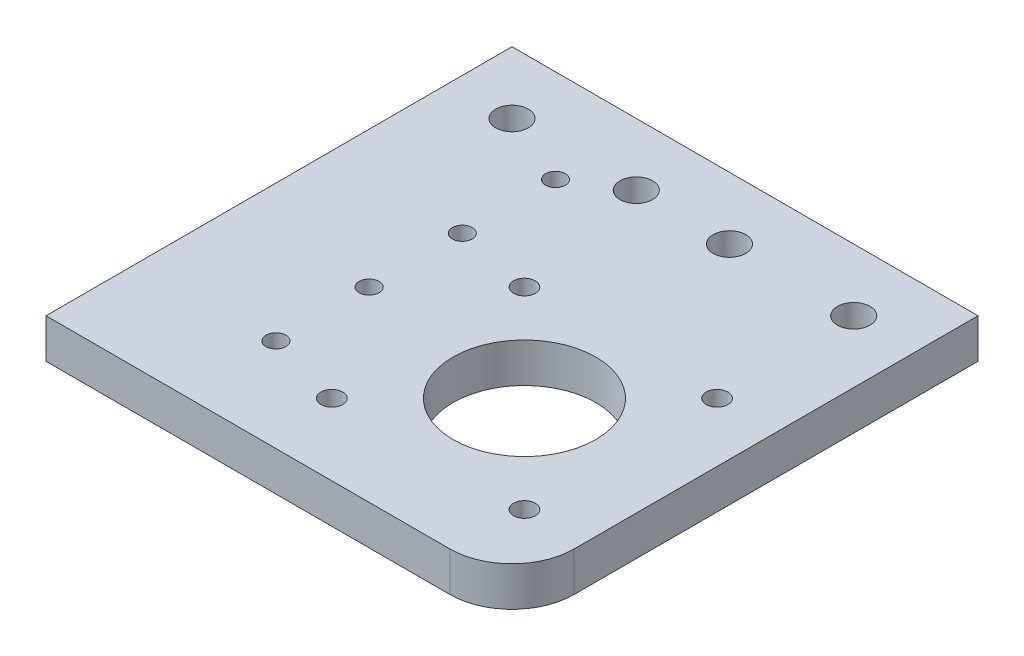
ISO-10303-21;
HEADER;
FILE_DESCRIPTION(('STEP AP214'),'2;1');
FILE_NAME('part.step','',(''),(''),'','','');
FILE_SCHEMA(('AUTOMOTIVE_DESIGN { 1 0 10303 214 1 1 1 1 }'));
ENDSEC;
DATA;
#1=APPLICATION_CONTEXT('core data for automotive mechanical design processes');
#2=APPLICATION_PROTOCOL_DEFINITION('international standard','automotive_design',2000,#1);
#3=PRODUCT_CONTEXT('',#1,'mechanical');
#4=PRODUCT('Part','Part','',(#3));
#5=PRODUCT_RELATED_PRODUCT_CATEGORY('part','',(#4));
#6=PRODUCT_DEFINITION_FORMATION('','',#4);
#7=PRODUCT_DEFINITION_CONTEXT('part definition',#1,'design');
#8=PRODUCT_DEFINITION('design','',#6,#7);
#9=PRODUCT_DEFINITION_SHAPE('','',#8);
#10=(LENGTH_UNIT() NAMED_UNIT(*) SI_UNIT(.MILLI.,.METRE.));
#11=(NAMED_UNIT(*) PLANE_ANGLE_UNIT() SI_UNIT($,.RADIAN.));
#12=(NAMED_UNIT(*) SI_UNIT($,.STERADIAN.) SOLID_ANGLE_UNIT());
#13=UNCERTAINTY_MEASURE_WITH_UNIT(LENGTH_MEASURE(1.E-05),#10,'distance_accuracy_value','');
#14=(GEOMETRIC_REPRESENTATION_CONTEXT(3) GLOBAL_UNCERTAINTY_ASSIGNED_CONTEXT((#13)) GLOBAL_UNIT_ASSIGNED_CONTEXT((#10,
#11,#12)) REPRESENTATION_CONTEXT('',''));
#15=CARTESIAN_POINT('',(0.,0.,0.));
#16=DIRECTION('',(0.,0.,1.));
#17=DIRECTION('',(1.,0.,0.));
#18=AXIS2_PLACEMENT_3D('',#15,#16,#17);
#19=CARTESIAN_POINT('',(0.,6.35,0.));
#20=DIRECTION('',(0.,1.,0.));
#21=DIRECTION('',(0.,0.,1.));
#22=AXIS2_PLACEMENT_3D('',#19,#20,#21);
#23=PLANE('',#22);
#24=CARTESIAN_POINT('',(21.9999999999996,6.35,60.));
#25=DIRECTION('',(0.,1.,0.));
#26=DIRECTION('',(0.,0.,1.));
#27=AXIS2_PLACEMENT_3D('',#24,#25,#26);
#28=CIRCLE('',#27,1.6);
#29=CARTESIAN_POINT('',(21.9999999999996,6.35,61.6));
#30=VERTEX_POINT('',#29);
#31=EDGE_CURVE('E191',#30,#30,#28,.T.);
#32=ORIENTED_EDGE('',*,*,#31,.F.);
#33=EDGE_LOOP('',(#32));
#34=FACE_BOUND('',#33,.T.);
#35=CARTESIAN_POINT('',(21.9999999999996,6.35,45.));
#36=DIRECTION('',(0.,1.,0.));
#37=DIRECTION('',(0.,0.,1.));
#38=AXIS2_PLACEMENT_3D('',#35,#36,#37);
#39=CIRCLE('',#38,1.6);
#40=CARTESIAN_POINT('',(21.9999999999996,6.35,46.6));
#41=VERTEX_POINT('',#40);
#42=EDGE_CURVE('E185',#41,#41,#39,.T.);
#43=ORIENTED_EDGE('',*,*,#42,.F.);
#44=EDGE_LOOP('',(#43));
#45=FACE_BOUND('',#44,.T.);
#46=CARTESIAN_POINT('',(21.9999999999996,6.35,30.));
#47=DIRECTION('',(0.,1.,0.));
#48=DIRECTION('',(0.,0.,1.));
#49=AXIS2_PLACEMENT_3D('',#46,#47,#48);
#50=CIRCLE('',#49,1.6);
#51=CARTESIAN_POINT('',(21.9999999999996,6.35,31.6));
#52=VERTEX_POINT('',#51);
#53=EDGE_CURVE('E179',#52,#52,#50,.T.);
#54=ORIENTED_EDGE('',*,*,#53,.F.);
#55=EDGE_LOOP('',(#54));
#56=FACE_BOUND('',#55,.T.);
#57=CARTESIAN_POINT('',(21.9999999999996,6.35,15.));
#58=DIRECTION('',(0.,1.,0.));
#59=DIRECTION('',(0.,0.,1.));
#60=AXIS2_PLACEMENT_3D('',#57,#58,#59);
#61=CIRCLE('',#60,1.6);
#62=CARTESIAN_POINT('',(21.9999999999996,6.35,16.6));
#63=VERTEX_POINT('',#62);
#64=EDGE_CURVE('E173',#63,#63,#61,.T.);
#65=ORIENTED_EDGE('',*,*,#64,.F.);
#66=EDGE_LOOP('',(#65));
#67=FACE_BOUND('',#66,.T.);
#68=CARTESIAN_POINT('',(34.4999999999996,6.35,63.4999999999995));
#69=DIRECTION('',(0.,1.,0.));
#70=DIRECTION('',(0.,0.,1.));
#71=AXIS2_PLACEMENT_3D('',#68,#69,#70);
#72=CIRCLE('',#71,1.75);
#73=CARTESIAN_POINT('',(34.4999999999996,6.35,65.2499999999995));
#74=VERTEX_POINT('',#73);
#75=EDGE_CURVE('E167',#74,#74,#72,.T.);
#76=ORIENTED_EDGE('',*,*,#75,.F.);
#77=EDGE_LOOP('',(#76));
#78=FACE_BOUND('',#77,.T.);
#79=CARTESIAN_POINT('',(65.4999999999996,6.35,32.4999999999995));
#80=DIRECTION('',(0.,1.,0.));
#81=DIRECTION('',(0.,0.,1.));
#82=AXIS2_PLACEMENT_3D('',#79,#80,#81);
#83=CIRCLE('',#82,1.75000000000013);
#84=CARTESIAN_POINT('',(65.4999999999996,6.35,34.2499999999996));
#85=VERTEX_POINT('',#84);
#86=EDGE_CURVE('E161',#85,#85,#83,.T.);
#87=ORIENTED_EDGE('',*,*,#86,.F.);
#88=EDGE_LOOP('',(#87));
#89=FACE_BOUND('',#88,.T.);
#90=CARTESIAN_POINT('',(34.4999999999996,6.35,32.4999999999995));
#91=DIRECTION('',(0.,1.,0.));
#92=DIRECTION('',(0.,0.,1.));
#93=AXIS2_PLACEMENT_3D('',#90,#91,#92);
#94=CIRCLE('',#93,1.75);
#95=CARTESIAN_POINT('',(34.4999999999996,6.35,34.2499999999995));
#96=VERTEX_POINT('',#95);
#97=EDGE_CURVE('E155',#96,#96,#94,.T.);
#98=ORIENTED_EDGE('',*,*,#97,.F.);
#99=EDGE_LOOP('',(#98));
#100=FACE_BOUND('',#99,.T.);
#101=CARTESIAN_POINT('',(50.,6.35,48.));
#102=DIRECTION('',(0.,1.,0.));
#103=DIRECTION('',(0.,0.,1.));
#104=AXIS2_PLACEMENT_3D('',#101,#102,#103);
#105=CIRCLE('',#104,11.4999999999998);
#106=CARTESIAN_POINT('',(50.,6.35,59.4999999999998));
#107=VERTEX_POINT('',#106);
#108=EDGE_CURVE('E149',#107,#107,#105,.T.);
#109=ORIENTED_EDGE('',*,*,#108,.F.);
#110=EDGE_LOOP('',(#109));
#111=FACE_BOUND('',#110,.T.);
#112=CARTESIAN_POINT('',(65.4999999999996,6.35,63.4999999999995));
#113=DIRECTION('',(0.,1.,0.));
#114=DIRECTION('',(0.,0.,1.));
#115=AXIS2_PLACEMENT_3D('',#112,#113,#114);
#116=CIRCLE('',#115,1.75);
#117=CARTESIAN_POINT('',(65.4999999999996,6.35,65.2499999999995));
#118=VERTEX_POINT('',#117);
#119=EDGE_CURVE('E143',#118,#118,#116,.T.);
#120=ORIENTED_EDGE('',*,*,#119,.F.);
#121=EDGE_LOOP('',(#120));
#122=FACE_BOUND('',#121,.T.);
#123=CARTESIAN_POINT('',(65.,6.35,10.));
#124=DIRECTION('',(0.,1.,0.));
#125=DIRECTION('',(0.,0.,1.));
#126=AXIS2_PLACEMENT_3D('',#123,#124,#125);
#127=CIRCLE('',#126,2.625);
#128=CARTESIAN_POINT('',(65.,6.35,12.625));
#129=VERTEX_POINT('',#128);
#130=EDGE_CURVE('E128',#129,#129,#127,.T.);
#131=ORIENTED_EDGE('',*,*,#130,.F.);
#132=EDGE_LOOP('',(#131));
#133=FACE_BOUND('',#132,.T.);
#134=CARTESIAN_POINT('',(9.99999999999999,6.35,10.));
#135=DIRECTION('',(0.,1.,0.));
#136=DIRECTION('',(0.,0.,1.));
#137=AXIS2_PLACEMENT_3D('',#134,#135,#136);
#138=CIRCLE('',#137,2.625);
#139=CARTESIAN_POINT('',(9.99999999999999,6.35,12.625));
#140=VERTEX_POINT('',#139);
#141=EDGE_CURVE('E116',#140,#140,#138,.T.);
#142=ORIENTED_EDGE('',*,*,#141,.F.);
#143=EDGE_LOOP('',(#142));
#144=FACE_BOUND('',#143,.T.);
#145=DIRECTION('',(1.,0.,0.));
#146=VECTOR('',#145,1.);
#147=CARTESIAN_POINT('',(0.,6.35,75.));
#148=LINE('',#147,#146);
#149=CARTESIAN_POINT('',(0.,6.35,75.));
#150=VERTEX_POINT('',#149);
#151=CARTESIAN_POINT('',(65.,6.35,75.));
#152=VERTEX_POINT('',#151);
#153=EDGE_CURVE('E76',#150,#152,#148,.T.);
#154=ORIENTED_EDGE('',*,*,#153,.T.);
#155=CARTESIAN_POINT('',(65.,6.35,65.));
#156=DIRECTION('',(0.,1.,0.));
#157=DIRECTION('',(0.,0.,1.));
#158=AXIS2_PLACEMENT_3D('',#155,#156,#157);
#159=CIRCLE('',#158,10.);
#160=CARTESIAN_POINT('',(75.,6.35,65.));
#161=VERTEX_POINT('',#160);
#162=EDGE_CURVE('E11',#152,#161,#159,.T.);
#163=ORIENTED_EDGE('',*,*,#162,.T.);
#164=DIRECTION('',(0.,0.,-1.));
#165=VECTOR('',#164,1.);
#166=CARTESIAN_POINT('',(75.,6.35,0.));
#167=LINE('',#166,#165);
#168=CARTESIAN_POINT('',(75.,6.35,0.));
#169=VERTEX_POINT('',#168);
#170=EDGE_CURVE('E84',#161,#169,#167,.T.);
#171=ORIENTED_EDGE('',*,*,#170,.T.);
#172=DIRECTION('',(-1.,0.,0.));
#173=VECTOR('',#172,1.);
#174=CARTESIAN_POINT('',(0.,6.35,0.));
#175=LINE('',#174,#173);
#176=CARTESIAN_POINT('',(0.,6.35,0.));
#177=VERTEX_POINT('',#176);
#178=EDGE_CURVE('E90',#169,#177,#175,.T.);
#179=ORIENTED_EDGE('',*,*,#178,.T.);
#180=DIRECTION('',(0.,0.,1.));
#181=VECTOR('',#180,1.);
#182=CARTESIAN_POINT('',(0.,6.35,0.));
#183=LINE('',#182,#181);
#184=EDGE_CURVE('E85',#177,#150,#183,.T.);
#185=ORIENTED_EDGE('',*,*,#184,.T.);
#186=EDGE_LOOP('',(#154,#163,#171,#179,#185));
#187=FACE_BOUND('',#186,.T.);
#188=CARTESIAN_POINT('',(45.,6.35,10.));
#189=DIRECTION('',(0.,1.,0.));
#190=DIRECTION('',(0.,0.,1.));
#191=AXIS2_PLACEMENT_3D('',#188,#189,#190);
#192=CIRCLE('',#191,2.62499999999999);
#193=CARTESIAN_POINT('',(45.,6.35,12.625));
#194=VERTEX_POINT('',#193);
#195=EDGE_CURVE('E122',#194,#194,#192,.T.);
#196=ORIENTED_EDGE('',*,*,#195,.F.);
#197=EDGE_LOOP('',(#196));
#198=FACE_BOUND('',#197,.T.);
#199=CARTESIAN_POINT('',(30.,6.35,10.));
#200=DIRECTION('',(0.,1.,0.));
#201=DIRECTION('',(0.,0.,1.));
#202=AXIS2_PLACEMENT_3D('',#199,#200,#201);
#203=CIRCLE('',#202,2.625);
#204=CARTESIAN_POINT('',(30.,6.35,12.625));
#205=VERTEX_POINT('',#204);
#206=EDGE_CURVE('E134',#205,#205,#203,.T.);
#207=ORIENTED_EDGE('',*,*,#206,.F.);
#208=EDGE_LOOP('',(#207));
#209=FACE_BOUND('',#208,.T.);
#210=ADVANCED_FACE('F33',(#34,#45,#56,#67,#78,#89,#100,#111,#122,#133,#144,#187,#198,#209),#23,.T.);
#211=CARTESIAN_POINT('',(0.,0.,0.));
#212=DIRECTION('',(0.,1.,0.));
#213=DIRECTION('',(0.,0.,1.));
#214=AXIS2_PLACEMENT_3D('',#211,#212,#213);
#215=PLANE('',#214);
#216=CARTESIAN_POINT('',(21.9999999999996,0.,60.));
#217=DIRECTION('',(0.,1.,0.));
#218=DIRECTION('',(0.,0.,1.));
#219=AXIS2_PLACEMENT_3D('',#216,#217,#218);
#220=CIRCLE('',#219,1.6);
#221=CARTESIAN_POINT('',(21.9999999999996,0.,61.6));
#222=VERTEX_POINT('',#221);
#223=EDGE_CURVE('E188',#222,#222,#220,.T.);
#224=ORIENTED_EDGE('',*,*,#223,.T.);
#225=EDGE_LOOP('',(#224));
#226=FACE_BOUND('',#225,.T.);
#227=CARTESIAN_POINT('',(21.9999999999996,0.,45.));
#228=DIRECTION('',(0.,1.,0.));
#229=DIRECTION('',(0.,0.,1.));
#230=AXIS2_PLACEMENT_3D('',#227,#228,#229);
#231=CIRCLE('',#230,1.6);
#232=CARTESIAN_POINT('',(21.9999999999996,0.,46.6));
#233=VERTEX_POINT('',#232);
#234=EDGE_CURVE('E182',#233,#233,#231,.T.);
#235=ORIENTED_EDGE('',*,*,#234,.T.);
#236=EDGE_LOOP('',(#235));
#237=FACE_BOUND('',#236,.T.);
#238=CARTESIAN_POINT('',(21.9999999999996,0.,30.));
#239=DIRECTION('',(0.,1.,0.));
#240=DIRECTION('',(0.,0.,1.));
#241=AXIS2_PLACEMENT_3D('',#238,#239,#240);
#242=CIRCLE('',#241,1.6);
#243=CARTESIAN_POINT('',(21.9999999999996,0.,31.6));
#244=VERTEX_POINT('',#243);
#245=EDGE_CURVE('E176',#244,#244,#242,.T.);
#246=ORIENTED_EDGE('',*,*,#245,.T.);
#247=EDGE_LOOP('',(#246));
#248=FACE_BOUND('',#247,.T.);
#249=CARTESIAN_POINT('',(21.9999999999996,0.,15.));
#250=DIRECTION('',(0.,1.,0.));
#251=DIRECTION('',(0.,0.,1.));
#252=AXIS2_PLACEMENT_3D('',#249,#250,#251);
#253=CIRCLE('',#252,1.6);
#254=CARTESIAN_POINT('',(21.9999999999996,0.,16.6));
#255=VERTEX_POINT('',#254);
#256=EDGE_CURVE('E170',#255,#255,#253,.T.);
#257=ORIENTED_EDGE('',*,*,#256,.T.);
#258=EDGE_LOOP('',(#257));
#259=FACE_BOUND('',#258,.T.);
#260=CARTESIAN_POINT('',(34.4999999999996,0.,63.4999999999995));
#261=DIRECTION('',(0.,1.,0.));
#262=DIRECTION('',(0.,0.,1.));
#263=AXIS2_PLACEMENT_3D('',#260,#261,#262);
#264=CIRCLE('',#263,1.75);
#265=CARTESIAN_POINT('',(34.4999999999996,0.,65.2499999999995));
#266=VERTEX_POINT('',#265);
#267=EDGE_CURVE('E164',#266,#266,#264,.T.);
#268=ORIENTED_EDGE('',*,*,#267,.T.);
#269=EDGE_LOOP('',(#268));
#270=FACE_BOUND('',#269,.T.);
#271=CARTESIAN_POINT('',(65.4999999999996,0.,32.4999999999995));
#272=DIRECTION('',(0.,1.,0.));
#273=DIRECTION('',(0.,0.,1.));
#274=AXIS2_PLACEMENT_3D('',#271,#272,#273);
#275=CIRCLE('',#274,1.75000000000013);
#276=CARTESIAN_POINT('',(65.4999999999996,0.,34.2499999999996));
#277=VERTEX_POINT('',#276);
#278=EDGE_CURVE('E158',#277,#277,#275,.T.);
#279=ORIENTED_EDGE('',*,*,#278,.T.);
#280=EDGE_LOOP('',(#279));
#281=FACE_BOUND('',#280,.T.);
#282=CARTESIAN_POINT('',(34.4999999999996,0.,32.4999999999995));
#283=DIRECTION('',(0.,1.,0.));
#284=DIRECTION('',(0.,0.,1.));
#285=AXIS2_PLACEMENT_3D('',#282,#283,#284);
#286=CIRCLE('',#285,1.75);
#287=CARTESIAN_POINT('',(34.4999999999996,0.,34.2499999999995));
#288=VERTEX_POINT('',#287);
#289=EDGE_CURVE('E152',#288,#288,#286,.T.);
#290=ORIENTED_EDGE('',*,*,#289,.T.);
#291=EDGE_LOOP('',(#290));
#292=FACE_BOUND('',#291,.T.);
#293=CARTESIAN_POINT('',(50.,0.,48.));
#294=DIRECTION('',(0.,1.,0.));
#295=DIRECTION('',(0.,0.,1.));
#296=AXIS2_PLACEMENT_3D('',#293,#294,#295);
#297=CIRCLE('',#296,11.4999999999998);
#298=CARTESIAN_POINT('',(50.,0.,59.4999999999998));
#299=VERTEX_POINT('',#298);
#300=EDGE_CURVE('E146',#299,#299,#297,.T.);
#301=ORIENTED_EDGE('',*,*,#300,.T.);
#302=EDGE_LOOP('',(#301));
#303=FACE_BOUND('',#302,.T.);
#304=CARTESIAN_POINT('',(65.4999999999996,0.,63.4999999999995));
#305=DIRECTION('',(0.,1.,0.));
#306=DIRECTION('',(0.,0.,1.));
#307=AXIS2_PLACEMENT_3D('',#304,#305,#306);
#308=CIRCLE('',#307,1.75);
#309=CARTESIAN_POINT('',(65.4999999999996,0.,65.2499999999995));
#310=VERTEX_POINT('',#309);
#311=EDGE_CURVE('E140',#310,#310,#308,.T.);
#312=ORIENTED_EDGE('',*,*,#311,.T.);
#313=EDGE_LOOP('',(#312));
#314=FACE_BOUND('',#313,.T.);
#315=DIRECTION('',(0.,0.,-1.));
#316=VECTOR('',#315,1.);
#317=CARTESIAN_POINT('',(75.,0.,0.));
#318=LINE('',#317,#316);
#319=CARTESIAN_POINT('',(75.,0.,65.));
#320=VERTEX_POINT('',#319);
#321=CARTESIAN_POINT('',(75.,0.,0.));
#322=VERTEX_POINT('',#321);
#323=EDGE_CURVE('E111',#320,#322,#318,.T.);
#324=ORIENTED_EDGE('',*,*,#323,.F.);
#325=CARTESIAN_POINT('',(65.,0.,65.));
#326=DIRECTION('',(0.,1.,0.));
#327=DIRECTION('',(0.,0.,1.));
#328=AXIS2_PLACEMENT_3D('',#325,#326,#327);
#329=CIRCLE('',#328,10.);
#330=CARTESIAN_POINT('',(65.,0.,75.));
#331=VERTEX_POINT('',#330);
#332=EDGE_CURVE('E55',#320,#331,#329,.F.);
#333=ORIENTED_EDGE('',*,*,#332,.T.);
#334=DIRECTION('',(1.,0.,0.));
#335=VECTOR('',#334,1.);
#336=CARTESIAN_POINT('',(0.,0.,75.));
#337=LINE('',#336,#335);
#338=CARTESIAN_POINT('',(0.,0.,75.));
#339=VERTEX_POINT('',#338);
#340=EDGE_CURVE('E113',#339,#331,#337,.T.);
#341=ORIENTED_EDGE('',*,*,#340,.F.);
#342=DIRECTION('',(0.,0.,1.));
#343=VECTOR('',#342,1.);
#344=CARTESIAN_POINT('',(0.,0.,0.));
#345=LINE('',#344,#343);
#346=CARTESIAN_POINT('',(0.,0.,0.));
#347=VERTEX_POINT('',#346);
#348=EDGE_CURVE('E98',#347,#339,#345,.T.);
#349=ORIENTED_EDGE('',*,*,#348,.F.);
#350=DIRECTION('',(-1.,0.,0.));
#351=VECTOR('',#350,1.);
#352=CARTESIAN_POINT('',(0.,0.,0.));
#353=LINE('',#352,#351);
#354=EDGE_CURVE('E94',#322,#347,#353,.T.);
#355=ORIENTED_EDGE('',*,*,#354,.F.);
#356=EDGE_LOOP('',(#324,#333,#341,#349,#355));
#357=FACE_BOUND('',#356,.T.);
#358=CARTESIAN_POINT('',(9.99999999999999,0.,10.));
#359=DIRECTION('',(0.,1.,0.));
#360=DIRECTION('',(0.,0.,1.));
#361=AXIS2_PLACEMENT_3D('',#358,#359,#360);
#362=CIRCLE('',#361,2.625);
#363=CARTESIAN_POINT('',(9.99999999999999,0.,12.625));
#364=VERTEX_POINT('',#363);
#365=EDGE_CURVE('E119',#364,#364,#362,.T.);
#366=ORIENTED_EDGE('',*,*,#365,.T.);
#367=EDGE_LOOP('',(#366));
#368=FACE_BOUND('',#367,.T.);
#369=CARTESIAN_POINT('',(45.,0.,10.));
#370=DIRECTION('',(0.,1.,0.));
#371=DIRECTION('',(0.,0.,1.));
#372=AXIS2_PLACEMENT_3D('',#369,#370,#371);
#373=CIRCLE('',#372,2.62499999999999);
#374=CARTESIAN_POINT('',(45.,0.,12.625));
#375=VERTEX_POINT('',#374);
#376=EDGE_CURVE('E125',#375,#375,#373,.T.);
#377=ORIENTED_EDGE('',*,*,#376,.T.);
#378=EDGE_LOOP('',(#377));
#379=FACE_BOUND('',#378,.T.);
#380=CARTESIAN_POINT('',(65.,0.,10.));
#381=DIRECTION('',(0.,1.,0.));
#382=DIRECTION('',(0.,0.,1.));
#383=AXIS2_PLACEMENT_3D('',#380,#381,#382);
#384=CIRCLE('',#383,2.625);
#385=CARTESIAN_POINT('',(65.,0.,12.625));
#386=VERTEX_POINT('',#385);
#387=EDGE_CURVE('E131',#386,#386,#384,.T.);
#388=ORIENTED_EDGE('',*,*,#387,.T.);
#389=EDGE_LOOP('',(#388));
#390=FACE_BOUND('',#389,.T.);
#391=CARTESIAN_POINT('',(30.,0.,10.));
#392=DIRECTION('',(0.,1.,0.));
#393=DIRECTION('',(0.,0.,1.));
#394=AXIS2_PLACEMENT_3D('',#391,#392,#393);
#395=CIRCLE('',#394,2.625);
#396=CARTESIAN_POINT('',(30.,0.,12.625));
#397=VERTEX_POINT('',#396);
#398=EDGE_CURVE('E137',#397,#397,#395,.T.);
#399=ORIENTED_EDGE('',*,*,#398,.T.);
#400=EDGE_LOOP('',(#399));
#401=FACE_BOUND('',#400,.T.);
#402=ADVANCED_FACE('F197',(#226,#237,#248,#259,#270,#281,#292,#303,#314,#357,#368,#379,#390,
#401),#215,.F.);
#403=CARTESIAN_POINT('',(0.,6.35,0.));
#404=DIRECTION('',(1.,0.,0.));
#405=DIRECTION('',(0.,0.,-1.));
#406=AXIS2_PLACEMENT_3D('',#403,#404,#405);
#407=PLANE('',#406);
#408=ORIENTED_EDGE('',*,*,#348,.T.);
#409=DIRECTION('',(0.,-1.,0.));
#410=VECTOR('',#409,1.);
#411=CARTESIAN_POINT('',(0.,6.35,75.));
#412=LINE('',#411,#410);
#413=EDGE_CURVE('E80',#150,#339,#412,.T.);
#414=ORIENTED_EDGE('',*,*,#413,.F.);
#415=ORIENTED_EDGE('',*,*,#184,.F.);
#416=DIRECTION('',(0.,-1.,0.));
#417=VECTOR('',#416,1.);
#418=CARTESIAN_POINT('',(0.,6.35,0.));
#419=LINE('',#418,#417);
#420=EDGE_CURVE('E105',#177,#347,#419,.T.);
#421=ORIENTED_EDGE('',*,*,#420,.T.);
#422=EDGE_LOOP('',(#408,#414,#415,#421));
#423=FACE_BOUND('',#422,.T.);
#424=ADVANCED_FACE('F96',(#423),#407,.F.);
#425=CARTESIAN_POINT('',(0.,6.35,75.));
#426=DIRECTION('',(0.,0.,-1.));
#427=DIRECTION('',(-1.,0.,0.));
#428=AXIS2_PLACEMENT_3D('',#425,#426,#427);
#429=PLANE('',#428);
#430=ORIENTED_EDGE('',*,*,#340,.T.);
#431=DIRECTION('',(0.,-1.,0.));
#432=VECTOR('',#431,1.);
#433=CARTESIAN_POINT('',(65.,6.35,75.));
#434=LINE('',#433,#432);
#435=EDGE_CURVE('E41',#331,#152,#434,.F.);
#436=ORIENTED_EDGE('',*,*,#435,.T.);
#437=ORIENTED_EDGE('',*,*,#153,.F.);
#438=ORIENTED_EDGE('',*,*,#413,.T.);
#439=EDGE_LOOP('',(#430,#436,#437,#438));
#440=FACE_BOUND('',#439,.T.);
#441=ADVANCED_FACE('F78',(#440),#429,.F.);
#442=CARTESIAN_POINT('',(75.,6.35,0.));
#443=DIRECTION('',(-1.,0.,0.));
#444=DIRECTION('',(0.,0.,1.));
#445=AXIS2_PLACEMENT_3D('',#442,#443,#444);
#446=PLANE('',#445);
#447=ORIENTED_EDGE('',*,*,#170,.F.);
#448=DIRECTION('',(0.,-1.,0.));
#449=VECTOR('',#448,1.);
#450=CARTESIAN_POINT('',(75.,6.35,65.));
#451=LINE('',#450,#449);
#452=EDGE_CURVE('E99',#161,#320,#451,.T.);
#453=ORIENTED_EDGE('',*,*,#452,.T.);
#454=ORIENTED_EDGE('',*,*,#323,.T.);
#455=DIRECTION('',(0.,-1.,0.));
#456=VECTOR('',#455,1.);
#457=CARTESIAN_POINT('',(75.,6.35,0.));
#458=LINE('',#457,#456);
#459=EDGE_CURVE('E100',#169,#322,#458,.T.);
#460=ORIENTED_EDGE('',*,*,#459,.F.);
#461=EDGE_LOOP('',(#447,#453,#454,#460));
#462=FACE_BOUND('',#461,.T.);
#463=ADVANCED_FACE('F268',(#462),#446,.F.);
#464=CARTESIAN_POINT('',(0.,6.35,0.));
#465=DIRECTION('',(0.,0.,1.));
#466=DIRECTION('',(1.,0.,0.));
#467=AXIS2_PLACEMENT_3D('',#464,#465,#466);
#468=PLANE('',#467);
#469=ORIENTED_EDGE('',*,*,#354,.T.);
#470=ORIENTED_EDGE('',*,*,#420,.F.);
#471=ORIENTED_EDGE('',*,*,#178,.F.);
#472=ORIENTED_EDGE('',*,*,#459,.T.);
#473=EDGE_LOOP('',(#469,#470,#471,#472));
#474=FACE_BOUND('',#473,.T.);
#475=ADVANCED_FACE('F234',(#474),#468,.F.);
#476=CARTESIAN_POINT('',(9.99999999999999,6.35,10.));
#477=DIRECTION('',(0.,-1.,0.));
#478=DIRECTION('',(0.,0.,-1.));
#479=AXIS2_PLACEMENT_3D('',#476,#477,#478);
#480=CYLINDRICAL_SURFACE('',#479,2.625);
#481=ORIENTED_EDGE('',*,*,#141,.T.);
#482=EDGE_LOOP('',(#481));
#483=FACE_BOUND('',#482,.T.);
#484=ORIENTED_EDGE('',*,*,#365,.F.);
#485=EDGE_LOOP('',(#484));
#486=FACE_BOUND('',#485,.T.);
#487=ADVANCED_FACE('F230',(#483,#486),#480,.F.);
#488=CARTESIAN_POINT('',(45.,6.35,10.));
#489=DIRECTION('',(0.,-1.,0.));
#490=DIRECTION('',(0.,0.,-1.));
#491=AXIS2_PLACEMENT_3D('',#488,#489,#490);
#492=CYLINDRICAL_SURFACE('',#491,2.62499999999999);
#493=ORIENTED_EDGE('',*,*,#195,.T.);
#494=EDGE_LOOP('',(#493));
#495=FACE_BOUND('',#494,.T.);
#496=ORIENTED_EDGE('',*,*,#376,.F.);
#497=EDGE_LOOP('',(#496));
#498=FACE_BOUND('',#497,.T.);
#499=ADVANCED_FACE('F233',(#495,#498),#492,.F.);
#500=CARTESIAN_POINT('',(65.,6.35,10.));
#501=DIRECTION('',(0.,-1.,0.));
#502=DIRECTION('',(0.,0.,-1.));
#503=AXIS2_PLACEMENT_3D('',#500,#501,#502);
#504=CYLINDRICAL_SURFACE('',#503,2.625);
#505=ORIENTED_EDGE('',*,*,#130,.T.);
#506=EDGE_LOOP('',(#505));
#507=FACE_BOUND('',#506,.T.);
#508=ORIENTED_EDGE('',*,*,#387,.F.);
#509=EDGE_LOOP('',(#508));
#510=FACE_BOUND('',#509,.T.);
#511=ADVANCED_FACE('F249',(#507,#510),#504,.F.);
#512=CARTESIAN_POINT('',(30.,6.35,10.));
#513=DIRECTION('',(0.,-1.,0.));
#514=DIRECTION('',(0.,0.,-1.));
#515=AXIS2_PLACEMENT_3D('',#512,#513,#514);
#516=CYLINDRICAL_SURFACE('',#515,2.625);
#517=ORIENTED_EDGE('',*,*,#206,.T.);
#518=EDGE_LOOP('',(#517));
#519=FACE_BOUND('',#518,.T.);
#520=ORIENTED_EDGE('',*,*,#398,.F.);
#521=EDGE_LOOP('',(#520));
#522=FACE_BOUND('',#521,.T.);
#523=ADVANCED_FACE('F247',(#519,#522),#516,.F.);
#524=CARTESIAN_POINT('',(65.,6.35,65.));
#525=DIRECTION('',(0.,-1.,0.));
#526=DIRECTION('',(0.,0.,-1.));
#527=AXIS2_PLACEMENT_3D('',#524,#525,#526);
#528=CYLINDRICAL_SURFACE('',#527,10.);
#529=ORIENTED_EDGE('',*,*,#162,.F.);
#530=ORIENTED_EDGE('',*,*,#435,.F.);
#531=ORIENTED_EDGE('',*,*,#332,.F.);
#532=ORIENTED_EDGE('',*,*,#452,.F.);
#533=EDGE_LOOP('',(#529,#530,#531,#532));
#534=FACE_BOUND('',#533,.T.);
#535=ADVANCED_FACE('F35',(#534),#528,.T.);
#536=CARTESIAN_POINT('',(65.4999999999996,0.,63.4999999999995));
#537=DIRECTION('',(0.,1.,0.));
#538=DIRECTION('',(0.,0.,1.));
#539=AXIS2_PLACEMENT_3D('',#536,#537,#538);
#540=CYLINDRICAL_SURFACE('',#539,1.75);
#541=ORIENTED_EDGE('',*,*,#311,.F.);
#542=EDGE_LOOP('',(#541));
#543=FACE_BOUND('',#542,.T.);
#544=ORIENTED_EDGE('',*,*,#119,.T.);
#545=EDGE_LOOP('',(#544));
#546=FACE_BOUND('',#545,.T.);
#547=ADVANCED_FACE('F256',(#543,#546),#540,.F.);
#548=CARTESIAN_POINT('',(50.,0.,48.));
#549=DIRECTION('',(0.,1.,0.));
#550=DIRECTION('',(0.,0.,1.));
#551=AXIS2_PLACEMENT_3D('',#548,#549,#550);
#552=CYLINDRICAL_SURFACE('',#551,11.4999999999998);
#553=ORIENTED_EDGE('',*,*,#300,.F.);
#554=EDGE_LOOP('',(#553));
#555=FACE_BOUND('',#554,.T.);
#556=ORIENTED_EDGE('',*,*,#108,.T.);
#557=EDGE_LOOP('',(#556));
#558=FACE_BOUND('',#557,.T.);
#559=ADVANCED_FACE('F322',(#555,#558),#552,.F.);
#560=CARTESIAN_POINT('',(34.4999999999996,0.,32.4999999999995));
#561=DIRECTION('',(0.,1.,0.));
#562=DIRECTION('',(0.,0.,1.));
#563=AXIS2_PLACEMENT_3D('',#560,#561,#562);
#564=CYLINDRICAL_SURFACE('',#563,1.75);
#565=ORIENTED_EDGE('',*,*,#289,.F.);
#566=EDGE_LOOP('',(#565));
#567=FACE_BOUND('',#566,.T.);
#568=ORIENTED_EDGE('',*,*,#97,.T.);
#569=EDGE_LOOP('',(#568));
#570=FACE_BOUND('',#569,.T.);
#571=ADVANCED_FACE('F330',(#567,#570),#564,.F.);
#572=CARTESIAN_POINT('',(65.4999999999996,0.,32.4999999999995));
#573=DIRECTION('',(0.,1.,0.));
#574=DIRECTION('',(0.,0.,1.));
#575=AXIS2_PLACEMENT_3D('',#572,#573,#574);
#576=CYLINDRICAL_SURFACE('',#575,1.75000000000013);
#577=ORIENTED_EDGE('',*,*,#278,.F.);
#578=EDGE_LOOP('',(#577));
#579=FACE_BOUND('',#578,.T.);
#580=ORIENTED_EDGE('',*,*,#86,.T.);
#581=EDGE_LOOP('',(#580));
#582=FACE_BOUND('',#581,.T.);
#583=ADVANCED_FACE('F338',(#579,#582),#576,.F.);
#584=CARTESIAN_POINT('',(34.4999999999996,0.,63.4999999999995));
#585=DIRECTION('',(0.,1.,0.));
#586=DIRECTION('',(0.,0.,1.));
#587=AXIS2_PLACEMENT_3D('',#584,#585,#586);
#588=CYLINDRICAL_SURFACE('',#587,1.75);
#589=ORIENTED_EDGE('',*,*,#267,.F.);
#590=EDGE_LOOP('',(#589));
#591=FACE_BOUND('',#590,.T.);
#592=ORIENTED_EDGE('',*,*,#75,.T.);
#593=EDGE_LOOP('',(#592));
#594=FACE_BOUND('',#593,.T.);
#595=ADVANCED_FACE('F347',(#591,#594),#588,.F.);
#596=CARTESIAN_POINT('',(21.9999999999996,0.,15.));
#597=DIRECTION('',(0.,1.,0.));
#598=DIRECTION('',(0.,0.,1.));
#599=AXIS2_PLACEMENT_3D('',#596,#597,#598);
#600=CYLINDRICAL_SURFACE('',#599,1.6);
#601=ORIENTED_EDGE('',*,*,#256,.F.);
#602=EDGE_LOOP('',(#601));
#603=FACE_BOUND('',#602,.T.);
#604=ORIENTED_EDGE('',*,*,#64,.T.);
#605=EDGE_LOOP('',(#604));
#606=FACE_BOUND('',#605,.T.);
#607=ADVANCED_FACE('F356',(#603,#606),#600,.F.);
#608=CARTESIAN_POINT('',(21.9999999999996,0.,30.));
#609=DIRECTION('',(0.,1.,0.));
#610=DIRECTION('',(0.,0.,1.));
#611=AXIS2_PLACEMENT_3D('',#608,#609,#610);
#612=CYLINDRICAL_SURFACE('',#611,1.6);
#613=ORIENTED_EDGE('',*,*,#245,.F.);
#614=EDGE_LOOP('',(#613));
#615=FACE_BOUND('',#614,.T.);
#616=ORIENTED_EDGE('',*,*,#53,.T.);
#617=EDGE_LOOP('',(#616));
#618=FACE_BOUND('',#617,.T.);
#619=ADVANCED_FACE('F366',(#615,#618),#612,.F.);
#620=CARTESIAN_POINT('',(21.9999999999996,0.,45.));
#621=DIRECTION('',(0.,1.,0.));
#622=DIRECTION('',(0.,0.,1.));
#623=AXIS2_PLACEMENT_3D('',#620,#621,#622);
#624=CYLINDRICAL_SURFACE('',#623,1.6);
#625=ORIENTED_EDGE('',*,*,#234,.F.);
#626=EDGE_LOOP('',(#625));
#627=FACE_BOUND('',#626,.T.);
#628=ORIENTED_EDGE('',*,*,#42,.T.);
#629=EDGE_LOOP('',(#628));
#630=FACE_BOUND('',#629,.T.);
#631=ADVANCED_FACE('F203',(#627,#630),#624,.F.);
#632=CARTESIAN_POINT('',(21.9999999999996,0.,60.));
#633=DIRECTION('',(0.,1.,0.));
#634=DIRECTION('',(0.,0.,1.));
#635=AXIS2_PLACEMENT_3D('',#632,#633,#634);
#636=CYLINDRICAL_SURFACE('',#635,1.6);
#637=ORIENTED_EDGE('',*,*,#223,.F.);
#638=EDGE_LOOP('',(#637));
#639=FACE_BOUND('',#638,.T.);
#640=ORIENTED_EDGE('',*,*,#31,.T.);
#641=EDGE_LOOP('',(#640));
#642=FACE_BOUND('',#641,.T.);
#643=ADVANCED_FACE('F200',(#639,#642),#636,.F.);
#644=CLOSED_SHELL('',(#210,#402,#424,#441,#463,#475,#487,#499,#511,#523,#535,#547,#559,#571,
#583,#595,#607,#619,#631,#643));
#645=MANIFOLD_SOLID_BREP('B2',#644);
#646=ADVANCED_BREP_SHAPE_REPRESENTATION('',(#18,#645),#14);
#647=SHAPE_DEFINITION_REPRESENTATION(#9,#646);
ENDSEC;
END-ISO-10303-21;
